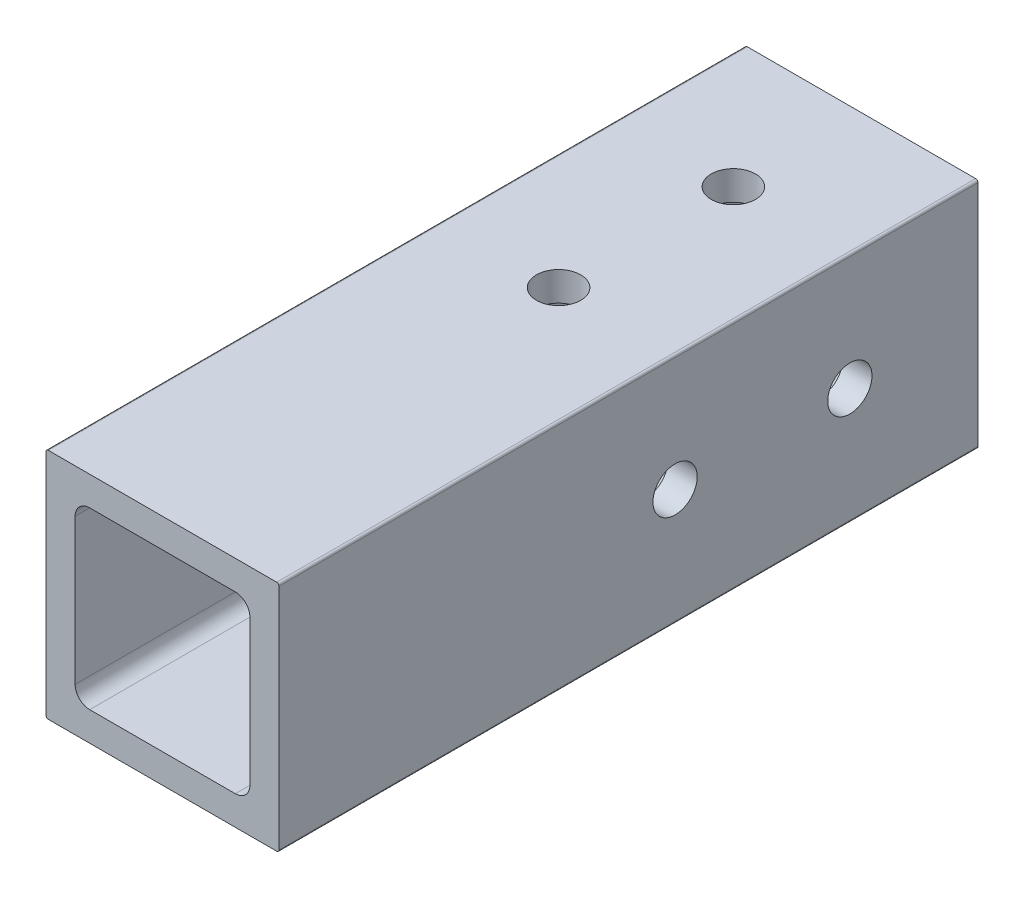
ISO-10303-21;
HEADER;
FILE_DESCRIPTION(('STEP AP214'),'2;1');
FILE_NAME('part.step','',(''),(''),'','','');
FILE_SCHEMA(('AUTOMOTIVE_DESIGN { 1 0 10303 214 1 1 1 1 }'));
ENDSEC;
DATA;
#1=APPLICATION_CONTEXT('core data for automotive mechanical design processes');
#2=APPLICATION_PROTOCOL_DEFINITION('international standard','automotive_design',2000,#1);
#3=PRODUCT_CONTEXT('',#1,'mechanical');
#4=PRODUCT('Part','Part','',(#3));
#5=PRODUCT_RELATED_PRODUCT_CATEGORY('part','',(#4));
#6=PRODUCT_DEFINITION_FORMATION('','',#4);
#7=PRODUCT_DEFINITION_CONTEXT('part definition',#1,'design');
#8=PRODUCT_DEFINITION('design','',#6,#7);
#9=PRODUCT_DEFINITION_SHAPE('','',#8);
#10=(LENGTH_UNIT() NAMED_UNIT(*) SI_UNIT(.MILLI.,.METRE.));
#11=(NAMED_UNIT(*) PLANE_ANGLE_UNIT() SI_UNIT($,.RADIAN.));
#12=(NAMED_UNIT(*) SI_UNIT($,.STERADIAN.) SOLID_ANGLE_UNIT());
#13=UNCERTAINTY_MEASURE_WITH_UNIT(LENGTH_MEASURE(1.E-05),#10,'distance_accuracy_value','');
#14=(GEOMETRIC_REPRESENTATION_CONTEXT(3) GLOBAL_UNCERTAINTY_ASSIGNED_CONTEXT((#13)) GLOBAL_UNIT_ASSIGNED_CONTEXT((#10,
#11,#12)) REPRESENTATION_CONTEXT('',''));
#15=CARTESIAN_POINT('',(0.,0.,0.));
#16=DIRECTION('',(0.,0.,1.));
#17=DIRECTION('',(1.,0.,0.));
#18=AXIS2_PLACEMENT_3D('',#15,#16,#17);
#19=CARTESIAN_POINT('',(3.175,4.7625,1828.8));
#20=DIRECTION('',(1.,0.,0.));
#21=DIRECTION('',(0.,1.,0.));
#22=AXIS2_PLACEMENT_3D('',#19,#20,#21);
#23=PLANE('',#22);
#24=CARTESIAN_POINT('',(3.175,12.3513725490173,1795.78));
#25=DIRECTION('',(1.,0.,0.));
#26=DIRECTION('',(0.,0.,-1.));
#27=AXIS2_PLACEMENT_3D('',#24,#25,#26);
#28=CIRCLE('',#27,2.41299999999989);
#29=CARTESIAN_POINT('',(3.175,12.3513725490173,1793.367));
#30=VERTEX_POINT('',#29);
#31=EDGE_CURVE('E395',#30,#30,#28,.F.);
#32=ORIENTED_EDGE('',*,*,#31,.T.);
#33=EDGE_LOOP('',(#32));
#34=FACE_BOUND('',#33,.T.);
#35=CARTESIAN_POINT('',(3.175,12.6999999999977,1814.83));
#36=DIRECTION('',(1.,0.,0.));
#37=DIRECTION('',(0.,0.,-1.));
#38=AXIS2_PLACEMENT_3D('',#35,#36,#37);
#39=CIRCLE('',#38,2.41299999999988);
#40=CARTESIAN_POINT('',(3.175,12.6999999999977,1812.417));
#41=VERTEX_POINT('',#40);
#42=EDGE_CURVE('E396',#41,#41,#39,.F.);
#43=ORIENTED_EDGE('',*,*,#42,.T.);
#44=EDGE_LOOP('',(#43));
#45=FACE_BOUND('',#44,.T.);
#46=DIRECTION('',(0.,-1.,0.));
#47=VECTOR('',#46,1.);
#48=CARTESIAN_POINT('',(3.175,4.7625,1752.6));
#49=LINE('',#48,#47);
#50=CARTESIAN_POINT('',(3.175,20.6375,1752.6));
#51=VERTEX_POINT('',#50);
#52=CARTESIAN_POINT('',(3.175,4.7625,1752.6));
#53=VERTEX_POINT('',#52);
#54=EDGE_CURVE('E57',#51,#53,#49,.T.);
#55=ORIENTED_EDGE('',*,*,#54,.F.);
#56=DIRECTION('',(0.,0.,-1.));
#57=VECTOR('',#56,1.);
#58=CARTESIAN_POINT('',(3.175,20.6375,1828.8));
#59=LINE('',#58,#57);
#60=CARTESIAN_POINT('',(3.175,20.6375,1828.8));
#61=VERTEX_POINT('',#60);
#62=EDGE_CURVE('E50',#61,#51,#59,.T.);
#63=ORIENTED_EDGE('',*,*,#62,.F.);
#64=DIRECTION('',(0.,-1.,0.));
#65=VECTOR('',#64,1.);
#66=CARTESIAN_POINT('',(3.175,4.7625,1828.8));
#67=LINE('',#66,#65);
#68=CARTESIAN_POINT('',(3.175,4.7625,1828.8));
#69=VERTEX_POINT('',#68);
#70=EDGE_CURVE('E216',#61,#69,#67,.T.);
#71=ORIENTED_EDGE('',*,*,#70,.T.);
#72=DIRECTION('',(0.,0.,-1.));
#73=VECTOR('',#72,1.);
#74=CARTESIAN_POINT('',(3.175,4.7625,1828.8));
#75=LINE('',#74,#73);
#76=EDGE_CURVE('E321',#69,#53,#75,.T.);
#77=ORIENTED_EDGE('',*,*,#76,.T.);
#78=EDGE_LOOP('',(#55,#63,#71,#77));
#79=FACE_BOUND('',#78,.T.);
#80=ADVANCED_FACE('F42',(#34,#45,#79),#23,.T.);
#81=CARTESIAN_POINT('',(4.7625,20.6375,1828.8));
#82=DIRECTION('',(0.,0.,-1.));
#83=DIRECTION('',(-1.,0.,0.));
#84=AXIS2_PLACEMENT_3D('',#81,#82,#83);
#85=CYLINDRICAL_SURFACE('',#84,1.5875);
#86=ORIENTED_EDGE('',*,*,#62,.T.);
#87=CARTESIAN_POINT('',(4.7625,20.6375,1752.6));
#88=DIRECTION('',(0.,0.,1.));
#89=DIRECTION('',(1.,0.,0.));
#90=AXIS2_PLACEMENT_3D('',#87,#88,#89);
#91=CIRCLE('',#90,1.5875);
#92=CARTESIAN_POINT('',(4.7625,22.225,1752.6));
#93=VERTEX_POINT('',#92);
#94=EDGE_CURVE('E301',#51,#93,#91,.F.);
#95=ORIENTED_EDGE('',*,*,#94,.T.);
#96=DIRECTION('',(0.,0.,-1.));
#97=VECTOR('',#96,1.);
#98=CARTESIAN_POINT('',(4.7625,22.225,1828.8));
#99=LINE('',#98,#97);
#100=CARTESIAN_POINT('',(4.7625,22.225,1828.8));
#101=VERTEX_POINT('',#100);
#102=EDGE_CURVE('E289',#101,#93,#99,.T.);
#103=ORIENTED_EDGE('',*,*,#102,.F.);
#104=CARTESIAN_POINT('',(4.7625,20.6375,1828.8));
#105=DIRECTION('',(0.,0.,1.));
#106=DIRECTION('',(-1.,0.,0.));
#107=AXIS2_PLACEMENT_3D('',#104,#105,#106);
#108=CIRCLE('',#107,1.5875);
#109=EDGE_CURVE('E221',#101,#61,#108,.T.);
#110=ORIENTED_EDGE('',*,*,#109,.T.);
#111=EDGE_LOOP('',(#86,#95,#103,#110));
#112=FACE_BOUND('',#111,.T.);
#113=ADVANCED_FACE('F299',(#112),#85,.F.);
#114=CARTESIAN_POINT('',(4.7625,22.225,1828.8));
#115=DIRECTION('',(0.,-1.,0.));
#116=DIRECTION('',(0.,0.,-1.));
#117=AXIS2_PLACEMENT_3D('',#114,#115,#116);
#118=PLANE('',#117);
#119=CARTESIAN_POINT('',(12.7,22.225,1766.57));
#120=DIRECTION('',(0.,-1.,0.));
#121=DIRECTION('',(0.,0.,-1.));
#122=AXIS2_PLACEMENT_3D('',#119,#120,#121);
#123=CIRCLE('',#122,2.41300000000001);
#124=CARTESIAN_POINT('',(12.7,22.225,1764.157));
#125=VERTEX_POINT('',#124);
#126=EDGE_CURVE('E355',#125,#125,#123,.T.);
#127=ORIENTED_EDGE('',*,*,#126,.F.);
#128=EDGE_LOOP('',(#127));
#129=FACE_BOUND('',#128,.T.);
#130=CARTESIAN_POINT('',(12.7,22.225,1785.62));
#131=DIRECTION('',(0.,-1.,0.));
#132=DIRECTION('',(0.,0.,-1.));
#133=AXIS2_PLACEMENT_3D('',#130,#131,#132);
#134=CIRCLE('',#133,2.41300000000001);
#135=CARTESIAN_POINT('',(12.7,22.225,1783.207));
#136=VERTEX_POINT('',#135);
#137=EDGE_CURVE('E364',#136,#136,#134,.T.);
#138=ORIENTED_EDGE('',*,*,#137,.F.);
#139=EDGE_LOOP('',(#138));
#140=FACE_BOUND('',#139,.T.);
#141=DIRECTION('',(-1.,0.,0.));
#142=VECTOR('',#141,1.);
#143=CARTESIAN_POINT('',(4.7625,22.225,1752.6));
#144=LINE('',#143,#142);
#145=CARTESIAN_POINT('',(20.6375,22.225,1752.6));
#146=VERTEX_POINT('',#145);
#147=EDGE_CURVE('E334',#146,#93,#144,.T.);
#148=ORIENTED_EDGE('',*,*,#147,.F.);
#149=DIRECTION('',(0.,0.,-1.));
#150=VECTOR('',#149,1.);
#151=CARTESIAN_POINT('',(20.6375,22.225,1828.8));
#152=LINE('',#151,#150);
#153=CARTESIAN_POINT('',(20.6375,22.225,1828.8));
#154=VERTEX_POINT('',#153);
#155=EDGE_CURVE('E236',#154,#146,#152,.T.);
#156=ORIENTED_EDGE('',*,*,#155,.F.);
#157=DIRECTION('',(-1.,0.,0.));
#158=VECTOR('',#157,1.);
#159=CARTESIAN_POINT('',(4.7625,22.225,1828.8));
#160=LINE('',#159,#158);
#161=EDGE_CURVE('E225',#154,#101,#160,.T.);
#162=ORIENTED_EDGE('',*,*,#161,.T.);
#163=ORIENTED_EDGE('',*,*,#102,.T.);
#164=EDGE_LOOP('',(#148,#156,#162,#163));
#165=FACE_BOUND('',#164,.T.);
#166=ADVANCED_FACE('F288',(#129,#140,#165),#118,.T.);
#167=CARTESIAN_POINT('',(20.6375,20.6375,1828.8));
#168=DIRECTION('',(0.,0.,-1.));
#169=DIRECTION('',(-1.,0.,0.));
#170=AXIS2_PLACEMENT_3D('',#167,#168,#169);
#171=CYLINDRICAL_SURFACE('',#170,1.5875);
#172=ORIENTED_EDGE('',*,*,#155,.T.);
#173=CARTESIAN_POINT('',(20.6375,20.6375,1752.6));
#174=DIRECTION('',(0.,0.,1.));
#175=DIRECTION('',(1.,0.,0.));
#176=AXIS2_PLACEMENT_3D('',#173,#174,#175);
#177=CIRCLE('',#176,1.5875);
#178=CARTESIAN_POINT('',(22.225,20.6375,1752.6));
#179=VERTEX_POINT('',#178);
#180=EDGE_CURVE('E336',#146,#179,#177,.F.);
#181=ORIENTED_EDGE('',*,*,#180,.T.);
#182=DIRECTION('',(0.,0.,-1.));
#183=VECTOR('',#182,1.);
#184=CARTESIAN_POINT('',(22.225,20.6375,1828.8));
#185=LINE('',#184,#183);
#186=CARTESIAN_POINT('',(22.225,20.6375,1828.8));
#187=VERTEX_POINT('',#186);
#188=EDGE_CURVE('E232',#187,#179,#185,.T.);
#189=ORIENTED_EDGE('',*,*,#188,.F.);
#190=CARTESIAN_POINT('',(20.6375,20.6375,1828.8));
#191=DIRECTION('',(0.,0.,1.));
#192=DIRECTION('',(-1.,0.,0.));
#193=AXIS2_PLACEMENT_3D('',#190,#191,#192);
#194=CIRCLE('',#193,1.5875);
#195=EDGE_CURVE('E211',#187,#154,#194,.T.);
#196=ORIENTED_EDGE('',*,*,#195,.T.);
#197=EDGE_LOOP('',(#172,#181,#189,#196));
#198=FACE_BOUND('',#197,.T.);
#199=ADVANCED_FACE('F456',(#198),#171,.F.);
#200=CARTESIAN_POINT('',(22.225,4.7625,1828.8));
#201=DIRECTION('',(-1.,0.,0.));
#202=DIRECTION('',(0.,0.,1.));
#203=AXIS2_PLACEMENT_3D('',#200,#201,#202);
#204=PLANE('',#203);
#205=CARTESIAN_POINT('',(22.225,12.7,1766.57));
#206=DIRECTION('',(-1.,0.,0.));
#207=DIRECTION('',(0.,0.,1.));
#208=AXIS2_PLACEMENT_3D('',#205,#206,#207);
#209=CIRCLE('',#208,2.4130000000001);
#210=CARTESIAN_POINT('',(22.225,12.7,1768.983));
#211=VERTEX_POINT('',#210);
#212=EDGE_CURVE('E383',#211,#211,#209,.F.);
#213=ORIENTED_EDGE('',*,*,#212,.T.);
#214=EDGE_LOOP('',(#213));
#215=FACE_BOUND('',#214,.T.);
#216=CARTESIAN_POINT('',(22.225,12.7,1785.62));
#217=DIRECTION('',(-1.,0.,0.));
#218=DIRECTION('',(0.,0.,1.));
#219=AXIS2_PLACEMENT_3D('',#216,#217,#218);
#220=CIRCLE('',#219,2.4130000000001);
#221=CARTESIAN_POINT('',(22.225,12.7,1788.033));
#222=VERTEX_POINT('',#221);
#223=EDGE_CURVE('E384',#222,#222,#220,.F.);
#224=ORIENTED_EDGE('',*,*,#223,.T.);
#225=EDGE_LOOP('',(#224));
#226=FACE_BOUND('',#225,.T.);
#227=DIRECTION('',(0.,1.,0.));
#228=VECTOR('',#227,1.);
#229=CARTESIAN_POINT('',(22.225,4.7625,1752.6));
#230=LINE('',#229,#228);
#231=CARTESIAN_POINT('',(22.225,4.7625,1752.6));
#232=VERTEX_POINT('',#231);
#233=EDGE_CURVE('E339',#232,#179,#230,.T.);
#234=ORIENTED_EDGE('',*,*,#233,.F.);
#235=DIRECTION('',(0.,0.,-1.));
#236=VECTOR('',#235,1.);
#237=CARTESIAN_POINT('',(22.225,4.7625,1828.8));
#238=LINE('',#237,#236);
#239=CARTESIAN_POINT('',(22.225,4.7625,1828.8));
#240=VERTEX_POINT('',#239);
#241=EDGE_CURVE('E237',#240,#232,#238,.T.);
#242=ORIENTED_EDGE('',*,*,#241,.F.);
#243=DIRECTION('',(0.,1.,0.));
#244=VECTOR('',#243,1.);
#245=CARTESIAN_POINT('',(22.225,4.7625,1828.8));
#246=LINE('',#245,#244);
#247=EDGE_CURVE('E207',#240,#187,#246,.T.);
#248=ORIENTED_EDGE('',*,*,#247,.T.);
#249=ORIENTED_EDGE('',*,*,#188,.T.);
#250=EDGE_LOOP('',(#234,#242,#248,#249));
#251=FACE_BOUND('',#250,.T.);
#252=ADVANCED_FACE('F496',(#215,#226,#251),#204,.T.);
#253=CARTESIAN_POINT('',(20.6375,4.7625,1828.8));
#254=DIRECTION('',(0.,0.,-1.));
#255=DIRECTION('',(-1.,0.,0.));
#256=AXIS2_PLACEMENT_3D('',#253,#254,#255);
#257=CYLINDRICAL_SURFACE('',#256,1.5875);
#258=ORIENTED_EDGE('',*,*,#241,.T.);
#259=CARTESIAN_POINT('',(20.6375,4.7625,1752.6));
#260=DIRECTION('',(0.,0.,1.));
#261=DIRECTION('',(1.,0.,0.));
#262=AXIS2_PLACEMENT_3D('',#259,#260,#261);
#263=CIRCLE('',#262,1.5875);
#264=CARTESIAN_POINT('',(20.6375,3.175,1752.6));
#265=VERTEX_POINT('',#264);
#266=EDGE_CURVE('E341',#232,#265,#263,.F.);
#267=ORIENTED_EDGE('',*,*,#266,.T.);
#268=DIRECTION('',(0.,0.,-1.));
#269=VECTOR('',#268,1.);
#270=CARTESIAN_POINT('',(20.6375,3.175,1828.8));
#271=LINE('',#270,#269);
#272=CARTESIAN_POINT('',(20.6375,3.175,1828.8));
#273=VERTEX_POINT('',#272);
#274=EDGE_CURVE('E263',#273,#265,#271,.T.);
#275=ORIENTED_EDGE('',*,*,#274,.F.);
#276=CARTESIAN_POINT('',(20.6375,4.7625,1828.8));
#277=DIRECTION('',(0.,0.,1.));
#278=DIRECTION('',(-1.,0.,0.));
#279=AXIS2_PLACEMENT_3D('',#276,#277,#278);
#280=CIRCLE('',#279,1.5875);
#281=EDGE_CURVE('E210',#273,#240,#280,.T.);
#282=ORIENTED_EDGE('',*,*,#281,.T.);
#283=EDGE_LOOP('',(#258,#267,#275,#282));
#284=FACE_BOUND('',#283,.T.);
#285=ADVANCED_FACE('F492',(#284),#257,.F.);
#286=CARTESIAN_POINT('',(4.7625,3.175,1828.8));
#287=DIRECTION('',(0.,1.,0.));
#288=DIRECTION('',(1.,0.,0.));
#289=AXIS2_PLACEMENT_3D('',#286,#287,#288);
#290=PLANE('',#289);
#291=CARTESIAN_POINT('',(12.7,3.175,1766.57));
#292=DIRECTION('',(0.,1.,0.));
#293=DIRECTION('',(0.,0.,1.));
#294=AXIS2_PLACEMENT_3D('',#291,#292,#293);
#295=CIRCLE('',#294,2.41300000000001);
#296=CARTESIAN_POINT('',(12.7,3.175,1768.983));
#297=VERTEX_POINT('',#296);
#298=EDGE_CURVE('E358',#297,#297,#295,.T.);
#299=ORIENTED_EDGE('',*,*,#298,.F.);
#300=EDGE_LOOP('',(#299));
#301=FACE_BOUND('',#300,.T.);
#302=CARTESIAN_POINT('',(12.7,3.175,1785.62));
#303=DIRECTION('',(0.,1.,0.));
#304=DIRECTION('',(0.,0.,1.));
#305=AXIS2_PLACEMENT_3D('',#302,#303,#304);
#306=CIRCLE('',#305,2.41300000000001);
#307=CARTESIAN_POINT('',(12.7,3.175,1788.033));
#308=VERTEX_POINT('',#307);
#309=EDGE_CURVE('E367',#308,#308,#306,.T.);
#310=ORIENTED_EDGE('',*,*,#309,.F.);
#311=EDGE_LOOP('',(#310));
#312=FACE_BOUND('',#311,.T.);
#313=DIRECTION('',(1.,0.,0.));
#314=VECTOR('',#313,1.);
#315=CARTESIAN_POINT('',(4.7625,3.175,1752.6));
#316=LINE('',#315,#314);
#317=CARTESIAN_POINT('',(4.7625,3.175,1752.6));
#318=VERTEX_POINT('',#317);
#319=EDGE_CURVE('E344',#318,#265,#316,.T.);
#320=ORIENTED_EDGE('',*,*,#319,.F.);
#321=DIRECTION('',(0.,0.,-1.));
#322=VECTOR('',#321,1.);
#323=CARTESIAN_POINT('',(4.7625,3.175,1828.8));
#324=LINE('',#323,#322);
#325=CARTESIAN_POINT('',(4.7625,3.175,1828.8));
#326=VERTEX_POINT('',#325);
#327=EDGE_CURVE('E267',#326,#318,#324,.T.);
#328=ORIENTED_EDGE('',*,*,#327,.F.);
#329=DIRECTION('',(1.,0.,0.));
#330=VECTOR('',#329,1.);
#331=CARTESIAN_POINT('',(4.7625,3.175,1828.8));
#332=LINE('',#331,#330);
#333=EDGE_CURVE('E253',#326,#273,#332,.T.);
#334=ORIENTED_EDGE('',*,*,#333,.T.);
#335=ORIENTED_EDGE('',*,*,#274,.T.);
#336=EDGE_LOOP('',(#320,#328,#334,#335));
#337=FACE_BOUND('',#336,.T.);
#338=ADVANCED_FACE('F489',(#301,#312,#337),#290,.T.);
#339=CARTESIAN_POINT('',(4.7625,4.7625,1828.8));
#340=DIRECTION('',(0.,0.,-1.));
#341=DIRECTION('',(-1.,0.,0.));
#342=AXIS2_PLACEMENT_3D('',#339,#340,#341);
#343=CYLINDRICAL_SURFACE('',#342,1.5875);
#344=ORIENTED_EDGE('',*,*,#327,.T.);
#345=CARTESIAN_POINT('',(4.7625,4.7625,1752.6));
#346=DIRECTION('',(0.,0.,1.));
#347=DIRECTION('',(1.,0.,0.));
#348=AXIS2_PLACEMENT_3D('',#345,#346,#347);
#349=CIRCLE('',#348,1.5875);
#350=EDGE_CURVE('E346',#318,#53,#349,.F.);
#351=ORIENTED_EDGE('',*,*,#350,.T.);
#352=ORIENTED_EDGE('',*,*,#76,.F.);
#353=CARTESIAN_POINT('',(4.7625,4.7625,1828.8));
#354=DIRECTION('',(0.,0.,1.));
#355=DIRECTION('',(1.,0.,0.));
#356=AXIS2_PLACEMENT_3D('',#353,#354,#355);
#357=CIRCLE('',#356,1.5875);
#358=EDGE_CURVE('E212',#69,#326,#357,.T.);
#359=ORIENTED_EDGE('',*,*,#358,.T.);
#360=EDGE_LOOP('',(#344,#351,#352,#359));
#361=FACE_BOUND('',#360,.T.);
#362=ADVANCED_FACE('F417',(#361),#343,.F.);
#363=CARTESIAN_POINT('',(0.,0.254,1828.8));
#364=DIRECTION('',(1.,0.,0.));
#365=DIRECTION('',(0.,1.,0.));
#366=AXIS2_PLACEMENT_3D('',#363,#364,#365);
#367=PLANE('',#366);
#368=CARTESIAN_POINT('',(0.,12.3513725490173,1795.78));
#369=DIRECTION('',(-1.,0.,0.));
#370=DIRECTION('',(0.,0.,1.));
#371=AXIS2_PLACEMENT_3D('',#368,#369,#370);
#372=CIRCLE('',#371,2.41299999999989);
#373=CARTESIAN_POINT('',(0.,12.3513725490173,1798.193));
#374=VERTEX_POINT('',#373);
#375=EDGE_CURVE('E387',#374,#374,#372,.T.);
#376=ORIENTED_EDGE('',*,*,#375,.F.);
#377=EDGE_LOOP('',(#376));
#378=FACE_BOUND('',#377,.T.);
#379=CARTESIAN_POINT('',(0.,12.6999999999977,1814.83));
#380=DIRECTION('',(-1.,0.,0.));
#381=DIRECTION('',(0.,0.,1.));
#382=AXIS2_PLACEMENT_3D('',#379,#380,#381);
#383=CIRCLE('',#382,2.41299999999988);
#384=CARTESIAN_POINT('',(0.,12.6999999999977,1817.243));
#385=VERTEX_POINT('',#384);
#386=EDGE_CURVE('E392',#385,#385,#383,.T.);
#387=ORIENTED_EDGE('',*,*,#386,.F.);
#388=EDGE_LOOP('',(#387));
#389=FACE_BOUND('',#388,.T.);
#390=DIRECTION('',(0.,0.,-1.));
#391=VECTOR('',#390,1.);
#392=CARTESIAN_POINT('',(0.,25.146,1828.8));
#393=LINE('',#392,#391);
#394=CARTESIAN_POINT('',(0.,25.146,1828.8));
#395=VERTEX_POINT('',#394);
#396=CARTESIAN_POINT('',(0.,25.146,1752.6));
#397=VERTEX_POINT('',#396);
#398=EDGE_CURVE('E262',#395,#397,#393,.T.);
#399=ORIENTED_EDGE('',*,*,#398,.T.);
#400=DIRECTION('',(0.,-1.,0.));
#401=VECTOR('',#400,1.);
#402=CARTESIAN_POINT('',(0.,0.254,1752.6));
#403=LINE('',#402,#401);
#404=CARTESIAN_POINT('',(0.,0.254,1752.6));
#405=VERTEX_POINT('',#404);
#406=EDGE_CURVE('E184',#397,#405,#403,.T.);
#407=ORIENTED_EDGE('',*,*,#406,.T.);
#408=DIRECTION('',(0.,0.,-1.));
#409=VECTOR('',#408,1.);
#410=CARTESIAN_POINT('',(0.,0.254,1828.8));
#411=LINE('',#410,#409);
#412=CARTESIAN_POINT('',(0.,0.254,1828.8));
#413=VERTEX_POINT('',#412);
#414=EDGE_CURVE('E193',#413,#405,#411,.T.);
#415=ORIENTED_EDGE('',*,*,#414,.F.);
#416=DIRECTION('',(0.,-1.,0.));
#417=VECTOR('',#416,1.);
#418=CARTESIAN_POINT('',(0.,0.254,1828.8));
#419=LINE('',#418,#417);
#420=EDGE_CURVE('E217',#395,#413,#419,.T.);
#421=ORIENTED_EDGE('',*,*,#420,.F.);
#422=EDGE_LOOP('',(#399,#407,#415,#421));
#423=FACE_BOUND('',#422,.T.);
#424=ADVANCED_FACE('F413',(#378,#389,#423),#367,.F.);
#425=CARTESIAN_POINT('',(0.254,25.146,1828.8));
#426=DIRECTION('',(0.,0.,-1.));
#427=DIRECTION('',(-1.,0.,0.));
#428=AXIS2_PLACEMENT_3D('',#425,#426,#427);
#429=CYLINDRICAL_SURFACE('',#428,0.254);
#430=CARTESIAN_POINT('',(0.254,25.146,1752.6));
#431=DIRECTION('',(0.,0.,1.));
#432=DIRECTION('',(1.,0.,0.));
#433=AXIS2_PLACEMENT_3D('',#430,#431,#432);
#434=CIRCLE('',#433,0.254);
#435=CARTESIAN_POINT('',(0.254000000000004,25.4,1752.6));
#436=VERTEX_POINT('',#435);
#437=EDGE_CURVE('E175',#397,#436,#434,.F.);
#438=ORIENTED_EDGE('',*,*,#437,.F.);
#439=ORIENTED_EDGE('',*,*,#398,.F.);
#440=CARTESIAN_POINT('',(0.254,25.146,1828.8));
#441=DIRECTION('',(0.,0.,1.));
#442=DIRECTION('',(-1.,0.,0.));
#443=AXIS2_PLACEMENT_3D('',#440,#441,#442);
#444=CIRCLE('',#443,0.254);
#445=CARTESIAN_POINT('',(0.254,25.4,1828.8));
#446=VERTEX_POINT('',#445);
#447=EDGE_CURVE('E238',#446,#395,#444,.T.);
#448=ORIENTED_EDGE('',*,*,#447,.F.);
#449=DIRECTION('',(0.,0.,-1.));
#450=VECTOR('',#449,1.);
#451=CARTESIAN_POINT('',(0.254,25.4,1828.8));
#452=LINE('',#451,#450);
#453=EDGE_CURVE('E258',#446,#436,#452,.T.);
#454=ORIENTED_EDGE('',*,*,#453,.T.);
#455=EDGE_LOOP('',(#438,#439,#448,#454));
#456=FACE_BOUND('',#455,.T.);
#457=ADVANCED_FACE('F416',(#456),#429,.T.);
#458=CARTESIAN_POINT('',(0.254,25.4,1828.8));
#459=DIRECTION('',(0.,-1.,0.));
#460=DIRECTION('',(0.,0.,-1.));
#461=AXIS2_PLACEMENT_3D('',#458,#459,#460);
#462=PLANE('',#461);
#463=CARTESIAN_POINT('',(12.7,25.4,1766.57));
#464=DIRECTION('',(0.,-1.,0.));
#465=DIRECTION('',(0.,0.,-1.));
#466=AXIS2_PLACEMENT_3D('',#463,#464,#465);
#467=CIRCLE('',#466,2.41300000000001);
#468=CARTESIAN_POINT('',(12.7,25.4,1764.157));
#469=VERTEX_POINT('',#468);
#470=EDGE_CURVE('E361',#469,#469,#467,.T.);
#471=ORIENTED_EDGE('',*,*,#470,.T.);
#472=EDGE_LOOP('',(#471));
#473=FACE_BOUND('',#472,.T.);
#474=CARTESIAN_POINT('',(12.7,25.4,1785.62));
#475=DIRECTION('',(0.,-1.,0.));
#476=DIRECTION('',(0.,0.,-1.));
#477=AXIS2_PLACEMENT_3D('',#474,#475,#476);
#478=CIRCLE('',#477,2.41300000000001);
#479=CARTESIAN_POINT('',(12.7,25.4,1783.207));
#480=VERTEX_POINT('',#479);
#481=EDGE_CURVE('E370',#480,#480,#478,.T.);
#482=ORIENTED_EDGE('',*,*,#481,.T.);
#483=EDGE_LOOP('',(#482));
#484=FACE_BOUND('',#483,.T.);
#485=DIRECTION('',(0.,0.,-1.));
#486=VECTOR('',#485,1.);
#487=CARTESIAN_POINT('',(25.146,25.4,1828.8));
#488=LINE('',#487,#486);
#489=CARTESIAN_POINT('',(25.146,25.4,1828.8));
#490=VERTEX_POINT('',#489);
#491=CARTESIAN_POINT('',(25.146,25.4,1752.6));
#492=VERTEX_POINT('',#491);
#493=EDGE_CURVE('E254',#490,#492,#488,.T.);
#494=ORIENTED_EDGE('',*,*,#493,.T.);
#495=DIRECTION('',(1.,0.,0.));
#496=VECTOR('',#495,1.);
#497=CARTESIAN_POINT('',(-135.222379220066,25.4,1752.6));
#498=LINE('',#497,#496);
#499=EDGE_CURVE('E185',#436,#492,#498,.T.);
#500=ORIENTED_EDGE('',*,*,#499,.F.);
#501=ORIENTED_EDGE('',*,*,#453,.F.);
#502=DIRECTION('',(-1.,0.,0.));
#503=VECTOR('',#502,1.);
#504=CARTESIAN_POINT('',(0.254,25.4,1828.8));
#505=LINE('',#504,#503);
#506=EDGE_CURVE('E230',#490,#446,#505,.T.);
#507=ORIENTED_EDGE('',*,*,#506,.F.);
#508=EDGE_LOOP('',(#494,#500,#501,#507));
#509=FACE_BOUND('',#508,.T.);
#510=ADVANCED_FACE('F428',(#473,#484,#509),#462,.F.);
#511=CARTESIAN_POINT('',(25.146,25.146,1828.8));
#512=DIRECTION('',(0.,0.,-1.));
#513=DIRECTION('',(-1.,0.,0.));
#514=AXIS2_PLACEMENT_3D('',#511,#512,#513);
#515=CYLINDRICAL_SURFACE('',#514,0.254);
#516=CARTESIAN_POINT('',(25.146,25.146,1752.6));
#517=DIRECTION('',(0.,0.,1.));
#518=DIRECTION('',(1.,0.,0.));
#519=AXIS2_PLACEMENT_3D('',#516,#517,#518);
#520=CIRCLE('',#519,0.254);
#521=CARTESIAN_POINT('',(25.4,25.146,1752.6));
#522=VERTEX_POINT('',#521);
#523=EDGE_CURVE('E348',#492,#522,#520,.F.);
#524=ORIENTED_EDGE('',*,*,#523,.F.);
#525=ORIENTED_EDGE('',*,*,#493,.F.);
#526=CARTESIAN_POINT('',(25.146,25.146,1828.8));
#527=DIRECTION('',(0.,0.,1.));
#528=DIRECTION('',(-1.,0.,0.));
#529=AXIS2_PLACEMENT_3D('',#526,#527,#528);
#530=CIRCLE('',#529,0.254);
#531=CARTESIAN_POINT('',(25.4,25.146,1828.8));
#532=VERTEX_POINT('',#531);
#533=EDGE_CURVE('E226',#532,#490,#530,.T.);
#534=ORIENTED_EDGE('',*,*,#533,.F.);
#535=DIRECTION('',(0.,0.,-1.));
#536=VECTOR('',#535,1.);
#537=CARTESIAN_POINT('',(25.4,25.146,1828.8));
#538=LINE('',#537,#536);
#539=EDGE_CURVE('E199',#532,#522,#538,.T.);
#540=ORIENTED_EDGE('',*,*,#539,.T.);
#541=EDGE_LOOP('',(#524,#525,#534,#540));
#542=FACE_BOUND('',#541,.T.);
#543=ADVANCED_FACE('F44',(#542),#515,.T.);
#544=CARTESIAN_POINT('',(25.4,0.254,1828.8));
#545=DIRECTION('',(-1.,0.,0.));
#546=DIRECTION('',(0.,0.,1.));
#547=AXIS2_PLACEMENT_3D('',#544,#545,#546);
#548=PLANE('',#547);
#549=CARTESIAN_POINT('',(25.4,12.7,1766.57));
#550=DIRECTION('',(1.,0.,0.));
#551=DIRECTION('',(0.,0.,-1.));
#552=AXIS2_PLACEMENT_3D('',#549,#550,#551);
#553=CIRCLE('',#552,2.4130000000001);
#554=CARTESIAN_POINT('',(25.4,12.7,1764.157));
#555=VERTEX_POINT('',#554);
#556=EDGE_CURVE('E377',#555,#555,#553,.T.);
#557=ORIENTED_EDGE('',*,*,#556,.F.);
#558=EDGE_LOOP('',(#557));
#559=FACE_BOUND('',#558,.T.);
#560=CARTESIAN_POINT('',(25.4,12.7,1785.62));
#561=DIRECTION('',(1.,0.,0.));
#562=DIRECTION('',(0.,0.,-1.));
#563=AXIS2_PLACEMENT_3D('',#560,#561,#562);
#564=CIRCLE('',#563,2.4130000000001);
#565=CARTESIAN_POINT('',(25.4,12.7,1783.207));
#566=VERTEX_POINT('',#565);
#567=EDGE_CURVE('E380',#566,#566,#564,.T.);
#568=ORIENTED_EDGE('',*,*,#567,.F.);
#569=EDGE_LOOP('',(#568));
#570=FACE_BOUND('',#569,.T.);
#571=DIRECTION('',(0.,0.,-1.));
#572=VECTOR('',#571,1.);
#573=CARTESIAN_POINT('',(25.4,0.254,1828.8));
#574=LINE('',#573,#572);
#575=CARTESIAN_POINT('',(25.4,0.254,1828.8));
#576=VERTEX_POINT('',#575);
#577=CARTESIAN_POINT('',(25.4,0.254,1752.6));
#578=VERTEX_POINT('',#577);
#579=EDGE_CURVE('E192',#576,#578,#574,.T.);
#580=ORIENTED_EDGE('',*,*,#579,.T.);
#581=DIRECTION('',(0.,1.,0.));
#582=VECTOR('',#581,1.);
#583=CARTESIAN_POINT('',(25.4,0.254,1752.6));
#584=LINE('',#583,#582);
#585=EDGE_CURVE('E171',#578,#522,#584,.T.);
#586=ORIENTED_EDGE('',*,*,#585,.T.);
#587=ORIENTED_EDGE('',*,*,#539,.F.);
#588=DIRECTION('',(0.,1.,0.));
#589=VECTOR('',#588,1.);
#590=CARTESIAN_POINT('',(25.4,0.254,1828.8));
#591=LINE('',#590,#589);
#592=EDGE_CURVE('E231',#576,#532,#591,.T.);
#593=ORIENTED_EDGE('',*,*,#592,.F.);
#594=EDGE_LOOP('',(#580,#586,#587,#593));
#595=FACE_BOUND('',#594,.T.);
#596=ADVANCED_FACE('F433',(#559,#570,#595),#548,.F.);
#597=CARTESIAN_POINT('',(25.146,0.254,1828.8));
#598=DIRECTION('',(0.,0.,-1.));
#599=DIRECTION('',(-1.,0.,0.));
#600=AXIS2_PLACEMENT_3D('',#597,#598,#599);
#601=CYLINDRICAL_SURFACE('',#600,0.254);
#602=CARTESIAN_POINT('',(25.146,0.254,1752.6));
#603=DIRECTION('',(0.,0.,1.));
#604=DIRECTION('',(1.,0.,0.));
#605=AXIS2_PLACEMENT_3D('',#602,#603,#604);
#606=CIRCLE('',#605,0.254);
#607=CARTESIAN_POINT('',(25.146,0.,1752.6));
#608=VERTEX_POINT('',#607);
#609=EDGE_CURVE('E168',#578,#608,#606,.F.);
#610=ORIENTED_EDGE('',*,*,#609,.F.);
#611=ORIENTED_EDGE('',*,*,#579,.F.);
#612=CARTESIAN_POINT('',(25.146,0.254,1828.8));
#613=DIRECTION('',(0.,0.,1.));
#614=DIRECTION('',(1.,0.,0.));
#615=AXIS2_PLACEMENT_3D('',#612,#613,#614);
#616=CIRCLE('',#615,0.254);
#617=CARTESIAN_POINT('',(25.146,0.,1828.8));
#618=VERTEX_POINT('',#617);
#619=EDGE_CURVE('E189',#618,#576,#616,.T.);
#620=ORIENTED_EDGE('',*,*,#619,.F.);
#621=DIRECTION('',(0.,0.,-1.));
#622=VECTOR('',#621,1.);
#623=CARTESIAN_POINT('',(25.146,0.,1828.8));
#624=LINE('',#623,#622);
#625=EDGE_CURVE('E181',#618,#608,#624,.T.);
#626=ORIENTED_EDGE('',*,*,#625,.T.);
#627=EDGE_LOOP('',(#610,#611,#620,#626));
#628=FACE_BOUND('',#627,.T.);
#629=ADVANCED_FACE('F187',(#628),#601,.T.);
#630=CARTESIAN_POINT('',(0.254,0.,1828.8));
#631=DIRECTION('',(0.,1.,0.));
#632=DIRECTION('',(1.,0.,0.));
#633=AXIS2_PLACEMENT_3D('',#630,#631,#632);
#634=PLANE('',#633);
#635=CARTESIAN_POINT('',(12.7,0.,1766.57));
#636=DIRECTION('',(0.,1.,0.));
#637=DIRECTION('',(0.,0.,1.));
#638=AXIS2_PLACEMENT_3D('',#635,#636,#637);
#639=CIRCLE('',#638,2.41300000000001);
#640=CARTESIAN_POINT('',(12.7,0.,1768.983));
#641=VERTEX_POINT('',#640);
#642=EDGE_CURVE('E373',#641,#641,#639,.T.);
#643=ORIENTED_EDGE('',*,*,#642,.T.);
#644=EDGE_LOOP('',(#643));
#645=FACE_BOUND('',#644,.T.);
#646=CARTESIAN_POINT('',(12.7,0.,1785.62));
#647=DIRECTION('',(0.,1.,0.));
#648=DIRECTION('',(0.,0.,1.));
#649=AXIS2_PLACEMENT_3D('',#646,#647,#648);
#650=CIRCLE('',#649,2.41300000000001);
#651=CARTESIAN_POINT('',(12.7,0.,1788.033));
#652=VERTEX_POINT('',#651);
#653=EDGE_CURVE('E374',#652,#652,#650,.T.);
#654=ORIENTED_EDGE('',*,*,#653,.T.);
#655=EDGE_LOOP('',(#654));
#656=FACE_BOUND('',#655,.T.);
#657=DIRECTION('',(0.,0.,-1.));
#658=VECTOR('',#657,1.);
#659=CARTESIAN_POINT('',(0.254,0.,1828.8));
#660=LINE('',#659,#658);
#661=CARTESIAN_POINT('',(0.254,0.,1828.8));
#662=VERTEX_POINT('',#661);
#663=CARTESIAN_POINT('',(0.254,0.,1752.6));
#664=VERTEX_POINT('',#663);
#665=EDGE_CURVE('E183',#662,#664,#660,.T.);
#666=ORIENTED_EDGE('',*,*,#665,.T.);
#667=DIRECTION('',(-1.,0.,0.));
#668=VECTOR('',#667,1.);
#669=CARTESIAN_POINT('',(-135.222379220066,0.,1752.6));
#670=LINE('',#669,#668);
#671=EDGE_CURVE('E64',#608,#664,#670,.T.);
#672=ORIENTED_EDGE('',*,*,#671,.F.);
#673=ORIENTED_EDGE('',*,*,#625,.F.);
#674=DIRECTION('',(1.,0.,0.));
#675=VECTOR('',#674,1.);
#676=CARTESIAN_POINT('',(0.254,0.,1828.8));
#677=LINE('',#676,#675);
#678=EDGE_CURVE('E247',#662,#618,#677,.T.);
#679=ORIENTED_EDGE('',*,*,#678,.F.);
#680=EDGE_LOOP('',(#666,#672,#673,#679));
#681=FACE_BOUND('',#680,.T.);
#682=ADVANCED_FACE('F179',(#645,#656,#681),#634,.F.);
#683=CARTESIAN_POINT('',(0.254,0.254,1828.8));
#684=DIRECTION('',(0.,0.,-1.));
#685=DIRECTION('',(-1.,0.,0.));
#686=AXIS2_PLACEMENT_3D('',#683,#684,#685);
#687=CYLINDRICAL_SURFACE('',#686,0.254);
#688=CARTESIAN_POINT('',(0.254,0.254,1752.6));
#689=DIRECTION('',(0.,0.,1.));
#690=DIRECTION('',(1.,0.,0.));
#691=AXIS2_PLACEMENT_3D('',#688,#689,#690);
#692=CIRCLE('',#691,0.254);
#693=EDGE_CURVE('E11',#664,#405,#692,.F.);
#694=ORIENTED_EDGE('',*,*,#693,.F.);
#695=ORIENTED_EDGE('',*,*,#665,.F.);
#696=CARTESIAN_POINT('',(0.254,0.254,1828.8));
#697=DIRECTION('',(0.,0.,1.));
#698=DIRECTION('',(-1.,0.,0.));
#699=AXIS2_PLACEMENT_3D('',#696,#697,#698);
#700=CIRCLE('',#699,0.254);
#701=EDGE_CURVE('E250',#413,#662,#700,.T.);
#702=ORIENTED_EDGE('',*,*,#701,.F.);
#703=ORIENTED_EDGE('',*,*,#414,.T.);
#704=EDGE_LOOP('',(#694,#695,#702,#703));
#705=FACE_BOUND('',#704,.T.);
#706=ADVANCED_FACE('F437',(#705),#687,.T.);
#707=CARTESIAN_POINT('',(0.254,0.254,1828.8));
#708=DIRECTION('',(0.,0.,-1.));
#709=DIRECTION('',(0.,-1.,0.));
#710=AXIS2_PLACEMENT_3D('',#707,#708,#709);
#711=PLANE('',#710);
#712=ORIENTED_EDGE('',*,*,#358,.F.);
#713=ORIENTED_EDGE('',*,*,#70,.F.);
#714=ORIENTED_EDGE('',*,*,#109,.F.);
#715=ORIENTED_EDGE('',*,*,#161,.F.);
#716=ORIENTED_EDGE('',*,*,#195,.F.);
#717=ORIENTED_EDGE('',*,*,#247,.F.);
#718=ORIENTED_EDGE('',*,*,#281,.F.);
#719=ORIENTED_EDGE('',*,*,#333,.F.);
#720=EDGE_LOOP('',(#712,#713,#714,#715,#716,#717,#718,#719));
#721=FACE_BOUND('',#720,.T.);
#722=ORIENTED_EDGE('',*,*,#701,.T.);
#723=ORIENTED_EDGE('',*,*,#678,.T.);
#724=ORIENTED_EDGE('',*,*,#619,.T.);
#725=ORIENTED_EDGE('',*,*,#592,.T.);
#726=ORIENTED_EDGE('',*,*,#533,.T.);
#727=ORIENTED_EDGE('',*,*,#506,.T.);
#728=ORIENTED_EDGE('',*,*,#447,.T.);
#729=ORIENTED_EDGE('',*,*,#420,.T.);
#730=EDGE_LOOP('',(#722,#723,#724,#725,#726,#727,#728,#729));
#731=FACE_BOUND('',#730,.T.);
#732=ADVANCED_FACE('F295',(#721,#731),#711,.F.);
#733=CARTESIAN_POINT('',(-135.222379220066,-1773.32765223686,1752.6));
#734=DIRECTION('',(0.,0.,1.));
#735=DIRECTION('',(1.,0.,0.));
#736=AXIS2_PLACEMENT_3D('',#733,#734,#735);
#737=PLANE('',#736);
#738=ORIENTED_EDGE('',*,*,#54,.T.);
#739=ORIENTED_EDGE('',*,*,#350,.F.);
#740=ORIENTED_EDGE('',*,*,#319,.T.);
#741=ORIENTED_EDGE('',*,*,#266,.F.);
#742=ORIENTED_EDGE('',*,*,#233,.T.);
#743=ORIENTED_EDGE('',*,*,#180,.F.);
#744=ORIENTED_EDGE('',*,*,#147,.T.);
#745=ORIENTED_EDGE('',*,*,#94,.F.);
#746=EDGE_LOOP('',(#738,#739,#740,#741,#742,#743,#744,#745));
#747=FACE_BOUND('',#746,.T.);
#748=ORIENTED_EDGE('',*,*,#523,.T.);
#749=ORIENTED_EDGE('',*,*,#585,.F.);
#750=ORIENTED_EDGE('',*,*,#609,.T.);
#751=ORIENTED_EDGE('',*,*,#671,.T.);
#752=ORIENTED_EDGE('',*,*,#693,.T.);
#753=ORIENTED_EDGE('',*,*,#406,.F.);
#754=ORIENTED_EDGE('',*,*,#437,.T.);
#755=ORIENTED_EDGE('',*,*,#499,.T.);
#756=EDGE_LOOP('',(#748,#749,#750,#751,#752,#753,#754,#755));
#757=FACE_BOUND('',#756,.T.);
#758=ADVANCED_FACE('F169',(#747,#757),#737,.F.);
#759=CARTESIAN_POINT('',(12.7,0.,1785.62));
#760=DIRECTION('',(0.,1.,0.));
#761=DIRECTION('',(0.,0.,1.));
#762=AXIS2_PLACEMENT_3D('',#759,#760,#761);
#763=CYLINDRICAL_SURFACE('',#762,2.41300000000001);
#764=ORIENTED_EDGE('',*,*,#309,.T.);
#765=EDGE_LOOP('',(#764));
#766=FACE_BOUND('',#765,.T.);
#767=ORIENTED_EDGE('',*,*,#653,.F.);
#768=EDGE_LOOP('',(#767));
#769=FACE_BOUND('',#768,.T.);
#770=ADVANCED_FACE('F461',(#766,#769),#763,.F.);
#771=CARTESIAN_POINT('',(12.7,0.,1766.57));
#772=DIRECTION('',(0.,1.,0.));
#773=DIRECTION('',(0.,0.,1.));
#774=AXIS2_PLACEMENT_3D('',#771,#772,#773);
#775=CYLINDRICAL_SURFACE('',#774,2.41300000000001);
#776=ORIENTED_EDGE('',*,*,#298,.T.);
#777=EDGE_LOOP('',(#776));
#778=FACE_BOUND('',#777,.T.);
#779=ORIENTED_EDGE('',*,*,#642,.F.);
#780=EDGE_LOOP('',(#779));
#781=FACE_BOUND('',#780,.T.);
#782=ADVANCED_FACE('F466',(#778,#781),#775,.F.);
#783=ORIENTED_EDGE('',*,*,#137,.T.);
#784=EDGE_LOOP('',(#783));
#785=FACE_BOUND('',#784,.T.);
#786=ORIENTED_EDGE('',*,*,#481,.F.);
#787=EDGE_LOOP('',(#786));
#788=FACE_BOUND('',#787,.T.);
#789=ADVANCED_FACE('F462',(#785,#788),#763,.F.);
#790=ORIENTED_EDGE('',*,*,#126,.T.);
#791=EDGE_LOOP('',(#790));
#792=FACE_BOUND('',#791,.T.);
#793=ORIENTED_EDGE('',*,*,#470,.F.);
#794=EDGE_LOOP('',(#793));
#795=FACE_BOUND('',#794,.T.);
#796=ADVANCED_FACE('F465',(#792,#795),#775,.F.);
#797=CARTESIAN_POINT('',(-0.001000000000001,12.7,1785.62));
#798=DIRECTION('',(1.,0.,0.));
#799=DIRECTION('',(0.,0.,-1.));
#800=AXIS2_PLACEMENT_3D('',#797,#798,#799);
#801=CYLINDRICAL_SURFACE('',#800,2.4130000000001);
#802=ORIENTED_EDGE('',*,*,#223,.F.);
#803=EDGE_LOOP('',(#802));
#804=FACE_BOUND('',#803,.T.);
#805=ORIENTED_EDGE('',*,*,#567,.T.);
#806=EDGE_LOOP('',(#805));
#807=FACE_BOUND('',#806,.T.);
#808=ADVANCED_FACE('F470',(#804,#807),#801,.F.);
#809=CARTESIAN_POINT('',(-0.001000000000001,12.7,1766.57));
#810=DIRECTION('',(1.,0.,0.));
#811=DIRECTION('',(0.,0.,-1.));
#812=AXIS2_PLACEMENT_3D('',#809,#810,#811);
#813=CYLINDRICAL_SURFACE('',#812,2.4130000000001);
#814=ORIENTED_EDGE('',*,*,#212,.F.);
#815=EDGE_LOOP('',(#814));
#816=FACE_BOUND('',#815,.T.);
#817=ORIENTED_EDGE('',*,*,#556,.T.);
#818=EDGE_LOOP('',(#817));
#819=FACE_BOUND('',#818,.T.);
#820=ADVANCED_FACE('F474',(#816,#819),#813,.F.);
#821=CARTESIAN_POINT('',(25.401,12.6999999999977,1814.83));
#822=DIRECTION('',(-1.,0.,0.));
#823=DIRECTION('',(0.,0.,1.));
#824=AXIS2_PLACEMENT_3D('',#821,#822,#823);
#825=CYLINDRICAL_SURFACE('',#824,2.41299999999988);
#826=ORIENTED_EDGE('',*,*,#42,.F.);
#827=EDGE_LOOP('',(#826));
#828=FACE_BOUND('',#827,.T.);
#829=ORIENTED_EDGE('',*,*,#386,.T.);
#830=EDGE_LOOP('',(#829));
#831=FACE_BOUND('',#830,.T.);
#832=ADVANCED_FACE('F409',(#828,#831),#825,.F.);
#833=CARTESIAN_POINT('',(25.401,12.3513725490173,1795.78));
#834=DIRECTION('',(-1.,0.,0.));
#835=DIRECTION('',(0.,0.,1.));
#836=AXIS2_PLACEMENT_3D('',#833,#834,#835);
#837=CYLINDRICAL_SURFACE('',#836,2.41299999999989);
#838=ORIENTED_EDGE('',*,*,#31,.F.);
#839=EDGE_LOOP('',(#838));
#840=FACE_BOUND('',#839,.T.);
#841=ORIENTED_EDGE('',*,*,#375,.T.);
#842=EDGE_LOOP('',(#841));
#843=FACE_BOUND('',#842,.T.);
#844=ADVANCED_FACE('F406',(#840,#843),#837,.F.);
#845=CLOSED_SHELL('',(#80,#113,#166,#199,#252,#285,#338,#362,#424,#457,#510,#543,#596,#629,#682,
#706,#732,#758,#770,#782,#789,#796,#808,#820,#832,#844));
#846=MANIFOLD_SOLID_BREP('B2',#845);
#847=ADVANCED_BREP_SHAPE_REPRESENTATION('',(#18,#846),#14);
#848=SHAPE_DEFINITION_REPRESENTATION(#9,#847);
ENDSEC;
END-ISO-10303-21;
